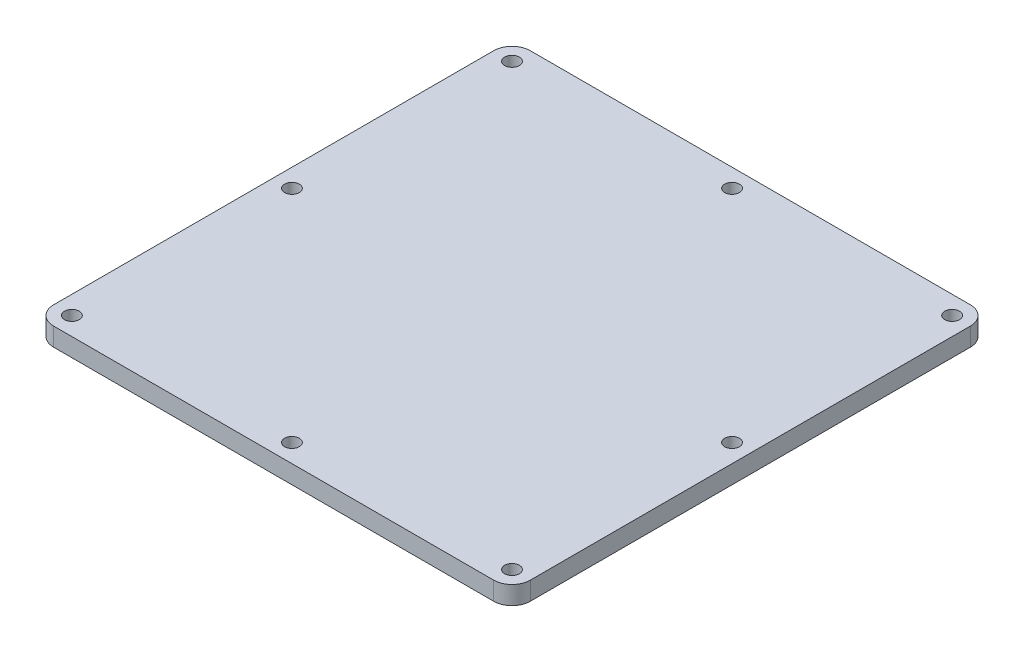
ISO-10303-21;
HEADER;
FILE_DESCRIPTION(('STEP AP214'),'2;1');
FILE_NAME('part.step','',(''),(''),'','','');
FILE_SCHEMA(('AUTOMOTIVE_DESIGN { 1 0 10303 214 1 1 1 1 }'));
ENDSEC;
DATA;
#1=APPLICATION_CONTEXT('core data for automotive mechanical design processes');
#2=APPLICATION_PROTOCOL_DEFINITION('international standard','automotive_design',2000,#1);
#3=PRODUCT_CONTEXT('',#1,'mechanical');
#4=PRODUCT('Part','Part','',(#3));
#5=PRODUCT_RELATED_PRODUCT_CATEGORY('part','',(#4));
#6=PRODUCT_DEFINITION_FORMATION('','',#4);
#7=PRODUCT_DEFINITION_CONTEXT('part definition',#1,'design');
#8=PRODUCT_DEFINITION('design','',#6,#7);
#9=PRODUCT_DEFINITION_SHAPE('','',#8);
#10=(LENGTH_UNIT() NAMED_UNIT(*) SI_UNIT(.MILLI.,.METRE.));
#11=(NAMED_UNIT(*) PLANE_ANGLE_UNIT() SI_UNIT($,.RADIAN.));
#12=(NAMED_UNIT(*) SI_UNIT($,.STERADIAN.) SOLID_ANGLE_UNIT());
#13=UNCERTAINTY_MEASURE_WITH_UNIT(LENGTH_MEASURE(1.E-05),#10,'distance_accuracy_value','');
#14=(GEOMETRIC_REPRESENTATION_CONTEXT(3) GLOBAL_UNCERTAINTY_ASSIGNED_CONTEXT((#13)) GLOBAL_UNIT_ASSIGNED_CONTEXT((#10,
#11,#12)) REPRESENTATION_CONTEXT('',''));
#15=CARTESIAN_POINT('',(0.,0.,0.));
#16=DIRECTION('',(0.,0.,1.));
#17=DIRECTION('',(1.,0.,0.));
#18=AXIS2_PLACEMENT_3D('',#15,#16,#17);
#19=CARTESIAN_POINT('',(-82.55,6.35,82.55));
#20=DIRECTION('',(1.,0.,0.));
#21=DIRECTION('',(0.,0.,-1.));
#22=AXIS2_PLACEMENT_3D('',#19,#20,#21);
#23=PLANE('',#22);
#24=DIRECTION('',(0.,0.,1.));
#25=VECTOR('',#24,1.);
#26=CARTESIAN_POINT('',(-82.55,0.,82.55));
#27=LINE('',#26,#25);
#28=CARTESIAN_POINT('',(-82.55,0.,-76.2));
#29=VERTEX_POINT('',#28);
#30=CARTESIAN_POINT('',(-82.55,0.,76.2));
#31=VERTEX_POINT('',#30);
#32=EDGE_CURVE('E159',#29,#31,#27,.T.);
#33=ORIENTED_EDGE('',*,*,#32,.T.);
#34=DIRECTION('',(0.,-1.,0.));
#35=VECTOR('',#34,1.);
#36=CARTESIAN_POINT('',(-82.55,6.35,76.2));
#37=LINE('',#36,#35);
#38=CARTESIAN_POINT('',(-82.55,6.35,76.2));
#39=VERTEX_POINT('',#38);
#40=EDGE_CURVE('E11',#31,#39,#37,.F.);
#41=ORIENTED_EDGE('',*,*,#40,.T.);
#42=DIRECTION('',(0.,0.,1.));
#43=VECTOR('',#42,1.);
#44=CARTESIAN_POINT('',(-82.55,6.35,82.55));
#45=LINE('',#44,#43);
#46=CARTESIAN_POINT('',(-82.55,6.35,-76.2));
#47=VERTEX_POINT('',#46);
#48=EDGE_CURVE('E127',#47,#39,#45,.T.);
#49=ORIENTED_EDGE('',*,*,#48,.F.);
#50=DIRECTION('',(0.,-1.,0.));
#51=VECTOR('',#50,1.);
#52=CARTESIAN_POINT('',(-82.55,6.35,-76.2));
#53=LINE('',#52,#51);
#54=EDGE_CURVE('E43',#47,#29,#53,.T.);
#55=ORIENTED_EDGE('',*,*,#54,.T.);
#56=EDGE_LOOP('',(#33,#41,#49,#55));
#57=FACE_BOUND('',#56,.T.);
#58=ADVANCED_FACE('F35',(#57),#23,.F.);
#59=CARTESIAN_POINT('',(82.55,6.35,82.55));
#60=DIRECTION('',(0.,0.,-1.));
#61=DIRECTION('',(-1.,0.,0.));
#62=AXIS2_PLACEMENT_3D('',#59,#60,#61);
#63=PLANE('',#62);
#64=DIRECTION('',(1.,0.,0.));
#65=VECTOR('',#64,1.);
#66=CARTESIAN_POINT('',(82.55,0.,82.55));
#67=LINE('',#66,#65);
#68=CARTESIAN_POINT('',(-76.2,0.,82.55));
#69=VERTEX_POINT('',#68);
#70=CARTESIAN_POINT('',(76.2,0.,82.55));
#71=VERTEX_POINT('',#70);
#72=EDGE_CURVE('E132',#69,#71,#67,.T.);
#73=ORIENTED_EDGE('',*,*,#72,.T.);
#74=DIRECTION('',(0.,-1.,0.));
#75=VECTOR('',#74,1.);
#76=CARTESIAN_POINT('',(76.2,6.35,82.55));
#77=LINE('',#76,#75);
#78=CARTESIAN_POINT('',(76.2,6.35,82.55));
#79=VERTEX_POINT('',#78);
#80=EDGE_CURVE('E50',#71,#79,#77,.F.);
#81=ORIENTED_EDGE('',*,*,#80,.T.);
#82=DIRECTION('',(1.,0.,0.));
#83=VECTOR('',#82,1.);
#84=CARTESIAN_POINT('',(82.55,6.35,82.55));
#85=LINE('',#84,#83);
#86=CARTESIAN_POINT('',(-76.2,6.35,82.55));
#87=VERTEX_POINT('',#86);
#88=EDGE_CURVE('E130',#87,#79,#85,.T.);
#89=ORIENTED_EDGE('',*,*,#88,.F.);
#90=DIRECTION('',(0.,-1.,0.));
#91=VECTOR('',#90,1.);
#92=CARTESIAN_POINT('',(-76.2,6.35,82.55));
#93=LINE('',#92,#91);
#94=EDGE_CURVE('E151',#87,#69,#93,.T.);
#95=ORIENTED_EDGE('',*,*,#94,.T.);
#96=EDGE_LOOP('',(#73,#81,#89,#95));
#97=FACE_BOUND('',#96,.T.);
#98=ADVANCED_FACE('F246',(#97),#63,.F.);
#99=CARTESIAN_POINT('',(82.55,6.35,82.55));
#100=DIRECTION('',(-1.,0.,0.));
#101=DIRECTION('',(0.,0.,1.));
#102=AXIS2_PLACEMENT_3D('',#99,#100,#101);
#103=PLANE('',#102);
#104=DIRECTION('',(0.,0.,-1.));
#105=VECTOR('',#104,1.);
#106=CARTESIAN_POINT('',(82.55,0.,82.55));
#107=LINE('',#106,#105);
#108=CARTESIAN_POINT('',(82.55,0.,76.2));
#109=VERTEX_POINT('',#108);
#110=CARTESIAN_POINT('',(82.55,0.,-76.2));
#111=VERTEX_POINT('',#110);
#112=EDGE_CURVE('E128',#109,#111,#107,.T.);
#113=ORIENTED_EDGE('',*,*,#112,.T.);
#114=DIRECTION('',(0.,-1.,0.));
#115=VECTOR('',#114,1.);
#116=CARTESIAN_POINT('',(82.55,6.35,-76.2));
#117=LINE('',#116,#115);
#118=CARTESIAN_POINT('',(82.55,6.35,-76.2));
#119=VERTEX_POINT('',#118);
#120=EDGE_CURVE('E106',#111,#119,#117,.F.);
#121=ORIENTED_EDGE('',*,*,#120,.T.);
#122=DIRECTION('',(0.,0.,-1.));
#123=VECTOR('',#122,1.);
#124=CARTESIAN_POINT('',(82.55,6.35,82.55));
#125=LINE('',#124,#123);
#126=CARTESIAN_POINT('',(82.55,6.35,76.2));
#127=VERTEX_POINT('',#126);
#128=EDGE_CURVE('E171',#127,#119,#125,.T.);
#129=ORIENTED_EDGE('',*,*,#128,.F.);
#130=DIRECTION('',(0.,-1.,0.));
#131=VECTOR('',#130,1.);
#132=CARTESIAN_POINT('',(82.55,6.35,76.2));
#133=LINE('',#132,#131);
#134=EDGE_CURVE('E111',#127,#109,#133,.T.);
#135=ORIENTED_EDGE('',*,*,#134,.T.);
#136=EDGE_LOOP('',(#113,#121,#129,#135));
#137=FACE_BOUND('',#136,.T.);
#138=ADVANCED_FACE('F243',(#137),#103,.F.);
#139=CARTESIAN_POINT('',(82.55,6.35,-82.55));
#140=DIRECTION('',(0.,0.,1.));
#141=DIRECTION('',(1.,0.,0.));
#142=AXIS2_PLACEMENT_3D('',#139,#140,#141);
#143=PLANE('',#142);
#144=DIRECTION('',(-1.,0.,0.));
#145=VECTOR('',#144,1.);
#146=CARTESIAN_POINT('',(82.55,6.35,-82.55));
#147=LINE('',#146,#145);
#148=CARTESIAN_POINT('',(76.2,6.35,-82.55));
#149=VERTEX_POINT('',#148);
#150=CARTESIAN_POINT('',(-76.2,6.35,-82.55));
#151=VERTEX_POINT('',#150);
#152=EDGE_CURVE('E121',#149,#151,#147,.T.);
#153=ORIENTED_EDGE('',*,*,#152,.F.);
#154=DIRECTION('',(0.,-1.,0.));
#155=VECTOR('',#154,1.);
#156=CARTESIAN_POINT('',(76.2,6.35,-82.55));
#157=LINE('',#156,#155);
#158=CARTESIAN_POINT('',(76.2,0.,-82.55));
#159=VERTEX_POINT('',#158);
#160=EDGE_CURVE('E105',#149,#159,#157,.T.);
#161=ORIENTED_EDGE('',*,*,#160,.T.);
#162=DIRECTION('',(-1.,0.,0.));
#163=VECTOR('',#162,1.);
#164=CARTESIAN_POINT('',(82.55,0.,-82.55));
#165=LINE('',#164,#163);
#166=CARTESIAN_POINT('',(-76.2,0.,-82.55));
#167=VERTEX_POINT('',#166);
#168=EDGE_CURVE('E118',#159,#167,#165,.T.);
#169=ORIENTED_EDGE('',*,*,#168,.T.);
#170=DIRECTION('',(0.,-1.,0.));
#171=VECTOR('',#170,1.);
#172=CARTESIAN_POINT('',(-76.2,6.35,-82.55));
#173=LINE('',#172,#171);
#174=EDGE_CURVE('E123',#167,#151,#173,.F.);
#175=ORIENTED_EDGE('',*,*,#174,.T.);
#176=EDGE_LOOP('',(#153,#161,#169,#175));
#177=FACE_BOUND('',#176,.T.);
#178=ADVANCED_FACE('F117',(#177),#143,.F.);
#179=CARTESIAN_POINT('',(0.,6.35,0.));
#180=DIRECTION('',(0.,1.,0.));
#181=DIRECTION('',(0.,0.,1.));
#182=AXIS2_PLACEMENT_3D('',#179,#180,#181);
#183=PLANE('',#182);
#184=CARTESIAN_POINT('',(-76.2,6.35,76.2));
#185=DIRECTION('',(0.,1.,0.));
#186=DIRECTION('',(0.,0.,1.));
#187=AXIS2_PLACEMENT_3D('',#184,#185,#186);
#188=CIRCLE('',#187,2.55269999999999);
#189=CARTESIAN_POINT('',(-76.2,6.35,78.7527));
#190=VERTEX_POINT('',#189);
#191=EDGE_CURVE('E216',#190,#190,#188,.T.);
#192=ORIENTED_EDGE('',*,*,#191,.F.);
#193=EDGE_LOOP('',(#192));
#194=FACE_BOUND('',#193,.T.);
#195=CARTESIAN_POINT('',(-76.2,6.35,-76.2));
#196=DIRECTION('',(0.,1.,0.));
#197=DIRECTION('',(0.,0.,1.));
#198=AXIS2_PLACEMENT_3D('',#195,#196,#197);
#199=CIRCLE('',#198,2.55269999999999);
#200=CARTESIAN_POINT('',(-76.2,6.35,-73.6473));
#201=VERTEX_POINT('',#200);
#202=EDGE_CURVE('E210',#201,#201,#199,.T.);
#203=ORIENTED_EDGE('',*,*,#202,.F.);
#204=EDGE_LOOP('',(#203));
#205=FACE_BOUND('',#204,.T.);
#206=CARTESIAN_POINT('',(76.2,6.35,-76.2));
#207=DIRECTION('',(0.,1.,0.));
#208=DIRECTION('',(0.,0.,1.));
#209=AXIS2_PLACEMENT_3D('',#206,#207,#208);
#210=CIRCLE('',#209,2.55269999999999);
#211=CARTESIAN_POINT('',(76.2,6.35,-73.6473));
#212=VERTEX_POINT('',#211);
#213=EDGE_CURVE('E204',#212,#212,#210,.T.);
#214=ORIENTED_EDGE('',*,*,#213,.F.);
#215=EDGE_LOOP('',(#214));
#216=FACE_BOUND('',#215,.T.);
#217=CARTESIAN_POINT('',(76.2,6.35,76.2));
#218=DIRECTION('',(0.,1.,0.));
#219=DIRECTION('',(0.,0.,1.));
#220=AXIS2_PLACEMENT_3D('',#217,#218,#219);
#221=CIRCLE('',#220,2.55269999999999);
#222=CARTESIAN_POINT('',(76.2,6.35,78.7527));
#223=VERTEX_POINT('',#222);
#224=EDGE_CURVE('E198',#223,#223,#221,.T.);
#225=ORIENTED_EDGE('',*,*,#224,.F.);
#226=EDGE_LOOP('',(#225));
#227=FACE_BOUND('',#226,.T.);
#228=CARTESIAN_POINT('',(0.,6.35,-76.2));
#229=DIRECTION('',(0.,1.,0.));
#230=DIRECTION('',(0.,0.,1.));
#231=AXIS2_PLACEMENT_3D('',#228,#229,#230);
#232=CIRCLE('',#231,2.5527);
#233=CARTESIAN_POINT('',(0.,6.35,-73.6473));
#234=VERTEX_POINT('',#233);
#235=EDGE_CURVE('E192',#234,#234,#232,.T.);
#236=ORIENTED_EDGE('',*,*,#235,.F.);
#237=EDGE_LOOP('',(#236));
#238=FACE_BOUND('',#237,.T.);
#239=CARTESIAN_POINT('',(0.,6.35,76.2));
#240=DIRECTION('',(0.,1.,0.));
#241=DIRECTION('',(0.,0.,1.));
#242=AXIS2_PLACEMENT_3D('',#239,#240,#241);
#243=CIRCLE('',#242,2.5527);
#244=CARTESIAN_POINT('',(0.,6.35,78.7527));
#245=VERTEX_POINT('',#244);
#246=EDGE_CURVE('E186',#245,#245,#243,.T.);
#247=ORIENTED_EDGE('',*,*,#246,.F.);
#248=EDGE_LOOP('',(#247));
#249=FACE_BOUND('',#248,.T.);
#250=CARTESIAN_POINT('',(-76.2,6.35,0.));
#251=DIRECTION('',(0.,1.,0.));
#252=DIRECTION('',(0.,0.,1.));
#253=AXIS2_PLACEMENT_3D('',#250,#251,#252);
#254=CIRCLE('',#253,2.55269999999999);
#255=CARTESIAN_POINT('',(-76.2,6.35,2.55270000000002));
#256=VERTEX_POINT('',#255);
#257=EDGE_CURVE('E180',#256,#256,#254,.T.);
#258=ORIENTED_EDGE('',*,*,#257,.F.);
#259=EDGE_LOOP('',(#258));
#260=FACE_BOUND('',#259,.T.);
#261=CARTESIAN_POINT('',(76.2,6.35,0.));
#262=DIRECTION('',(0.,1.,0.));
#263=DIRECTION('',(0.,0.,1.));
#264=AXIS2_PLACEMENT_3D('',#261,#262,#263);
#265=CIRCLE('',#264,2.55269999999999);
#266=CARTESIAN_POINT('',(76.2,6.35,2.5527));
#267=VERTEX_POINT('',#266);
#268=EDGE_CURVE('E167',#267,#267,#265,.T.);
#269=ORIENTED_EDGE('',*,*,#268,.F.);
#270=EDGE_LOOP('',(#269));
#271=FACE_BOUND('',#270,.T.);
#272=ORIENTED_EDGE('',*,*,#128,.T.);
#273=CARTESIAN_POINT('',(76.2,6.35,-76.2));
#274=DIRECTION('',(0.,1.,0.));
#275=DIRECTION('',(0.,0.,1.));
#276=AXIS2_PLACEMENT_3D('',#273,#274,#275);
#277=CIRCLE('',#276,6.35);
#278=EDGE_CURVE('E149',#119,#149,#277,.T.);
#279=ORIENTED_EDGE('',*,*,#278,.T.);
#280=ORIENTED_EDGE('',*,*,#152,.T.);
#281=CARTESIAN_POINT('',(-76.2,6.35,-76.2));
#282=DIRECTION('',(0.,1.,0.));
#283=DIRECTION('',(0.,0.,1.));
#284=AXIS2_PLACEMENT_3D('',#281,#282,#283);
#285=CIRCLE('',#284,6.35);
#286=EDGE_CURVE('E144',#151,#47,#285,.T.);
#287=ORIENTED_EDGE('',*,*,#286,.T.);
#288=ORIENTED_EDGE('',*,*,#48,.T.);
#289=CARTESIAN_POINT('',(-76.2,6.35,76.2));
#290=DIRECTION('',(0.,1.,0.));
#291=DIRECTION('',(0.,0.,1.));
#292=AXIS2_PLACEMENT_3D('',#289,#290,#291);
#293=CIRCLE('',#292,6.35);
#294=EDGE_CURVE('E57',#39,#87,#293,.T.);
#295=ORIENTED_EDGE('',*,*,#294,.T.);
#296=ORIENTED_EDGE('',*,*,#88,.T.);
#297=CARTESIAN_POINT('',(76.2,6.35,76.2));
#298=DIRECTION('',(0.,1.,0.));
#299=DIRECTION('',(0.,0.,1.));
#300=AXIS2_PLACEMENT_3D('',#297,#298,#299);
#301=CIRCLE('',#300,6.35);
#302=EDGE_CURVE('E147',#79,#127,#301,.T.);
#303=ORIENTED_EDGE('',*,*,#302,.T.);
#304=EDGE_LOOP('',(#272,#279,#280,#287,#288,#295,#296,#303));
#305=FACE_BOUND('',#304,.T.);
#306=ADVANCED_FACE('F222',(#194,#205,#216,#227,#238,#249,#260,#271,#305),#183,.T.);
#307=CARTESIAN_POINT('',(0.,0.,0.));
#308=DIRECTION('',(0.,1.,0.));
#309=DIRECTION('',(0.,0.,1.));
#310=AXIS2_PLACEMENT_3D('',#307,#308,#309);
#311=PLANE('',#310);
#312=CARTESIAN_POINT('',(-76.2,0.,76.2));
#313=DIRECTION('',(0.,1.,0.));
#314=DIRECTION('',(0.,0.,1.));
#315=AXIS2_PLACEMENT_3D('',#312,#313,#314);
#316=CIRCLE('',#315,2.55269999999999);
#317=CARTESIAN_POINT('',(-76.2,0.,78.7527));
#318=VERTEX_POINT('',#317);
#319=EDGE_CURVE('E213',#318,#318,#316,.T.);
#320=ORIENTED_EDGE('',*,*,#319,.T.);
#321=EDGE_LOOP('',(#320));
#322=FACE_BOUND('',#321,.T.);
#323=CARTESIAN_POINT('',(-76.2,0.,-76.2));
#324=DIRECTION('',(0.,1.,0.));
#325=DIRECTION('',(0.,0.,1.));
#326=AXIS2_PLACEMENT_3D('',#323,#324,#325);
#327=CIRCLE('',#326,2.55269999999999);
#328=CARTESIAN_POINT('',(-76.2,0.,-73.6473));
#329=VERTEX_POINT('',#328);
#330=EDGE_CURVE('E207',#329,#329,#327,.T.);
#331=ORIENTED_EDGE('',*,*,#330,.T.);
#332=EDGE_LOOP('',(#331));
#333=FACE_BOUND('',#332,.T.);
#334=CARTESIAN_POINT('',(76.2,0.,-76.2));
#335=DIRECTION('',(0.,1.,0.));
#336=DIRECTION('',(0.,0.,1.));
#337=AXIS2_PLACEMENT_3D('',#334,#335,#336);
#338=CIRCLE('',#337,2.55269999999999);
#339=CARTESIAN_POINT('',(76.2,0.,-73.6473));
#340=VERTEX_POINT('',#339);
#341=EDGE_CURVE('E201',#340,#340,#338,.T.);
#342=ORIENTED_EDGE('',*,*,#341,.T.);
#343=EDGE_LOOP('',(#342));
#344=FACE_BOUND('',#343,.T.);
#345=CARTESIAN_POINT('',(76.2,0.,76.2));
#346=DIRECTION('',(0.,1.,0.));
#347=DIRECTION('',(0.,0.,1.));
#348=AXIS2_PLACEMENT_3D('',#345,#346,#347);
#349=CIRCLE('',#348,2.55269999999999);
#350=CARTESIAN_POINT('',(76.2,0.,78.7527));
#351=VERTEX_POINT('',#350);
#352=EDGE_CURVE('E195',#351,#351,#349,.T.);
#353=ORIENTED_EDGE('',*,*,#352,.T.);
#354=EDGE_LOOP('',(#353));
#355=FACE_BOUND('',#354,.T.);
#356=CARTESIAN_POINT('',(0.,0.,-76.2));
#357=DIRECTION('',(0.,1.,0.));
#358=DIRECTION('',(0.,0.,1.));
#359=AXIS2_PLACEMENT_3D('',#356,#357,#358);
#360=CIRCLE('',#359,2.5527);
#361=CARTESIAN_POINT('',(0.,0.,-73.6473));
#362=VERTEX_POINT('',#361);
#363=EDGE_CURVE('E189',#362,#362,#360,.T.);
#364=ORIENTED_EDGE('',*,*,#363,.T.);
#365=EDGE_LOOP('',(#364));
#366=FACE_BOUND('',#365,.T.);
#367=CARTESIAN_POINT('',(0.,0.,76.2));
#368=DIRECTION('',(0.,1.,0.));
#369=DIRECTION('',(0.,0.,1.));
#370=AXIS2_PLACEMENT_3D('',#367,#368,#369);
#371=CIRCLE('',#370,2.5527);
#372=CARTESIAN_POINT('',(0.,0.,78.7527));
#373=VERTEX_POINT('',#372);
#374=EDGE_CURVE('E183',#373,#373,#371,.T.);
#375=ORIENTED_EDGE('',*,*,#374,.T.);
#376=EDGE_LOOP('',(#375));
#377=FACE_BOUND('',#376,.T.);
#378=CARTESIAN_POINT('',(-76.2,0.,0.));
#379=DIRECTION('',(0.,1.,0.));
#380=DIRECTION('',(0.,0.,1.));
#381=AXIS2_PLACEMENT_3D('',#378,#379,#380);
#382=CIRCLE('',#381,2.55269999999999);
#383=CARTESIAN_POINT('',(-76.2,0.,2.55270000000002));
#384=VERTEX_POINT('',#383);
#385=EDGE_CURVE('E177',#384,#384,#382,.T.);
#386=ORIENTED_EDGE('',*,*,#385,.T.);
#387=EDGE_LOOP('',(#386));
#388=FACE_BOUND('',#387,.T.);
#389=CARTESIAN_POINT('',(76.2,0.,0.));
#390=DIRECTION('',(0.,1.,0.));
#391=DIRECTION('',(0.,0.,1.));
#392=AXIS2_PLACEMENT_3D('',#389,#390,#391);
#393=CIRCLE('',#392,2.55269999999999);
#394=CARTESIAN_POINT('',(76.2,0.,2.5527));
#395=VERTEX_POINT('',#394);
#396=EDGE_CURVE('E164',#395,#395,#393,.T.);
#397=ORIENTED_EDGE('',*,*,#396,.T.);
#398=EDGE_LOOP('',(#397));
#399=FACE_BOUND('',#398,.T.);
#400=ORIENTED_EDGE('',*,*,#168,.F.);
#401=CARTESIAN_POINT('',(76.2,0.,-76.2));
#402=DIRECTION('',(0.,1.,0.));
#403=DIRECTION('',(0.,0.,1.));
#404=AXIS2_PLACEMENT_3D('',#401,#402,#403);
#405=CIRCLE('',#404,6.35);
#406=EDGE_CURVE('E101',#159,#111,#405,.F.);
#407=ORIENTED_EDGE('',*,*,#406,.T.);
#408=ORIENTED_EDGE('',*,*,#112,.F.);
#409=CARTESIAN_POINT('',(76.2,0.,76.2));
#410=DIRECTION('',(0.,1.,0.));
#411=DIRECTION('',(0.,0.,1.));
#412=AXIS2_PLACEMENT_3D('',#409,#410,#411);
#413=CIRCLE('',#412,6.35);
#414=EDGE_CURVE('E112',#109,#71,#413,.F.);
#415=ORIENTED_EDGE('',*,*,#414,.T.);
#416=ORIENTED_EDGE('',*,*,#72,.F.);
#417=CARTESIAN_POINT('',(-76.2,0.,76.2));
#418=DIRECTION('',(0.,1.,0.));
#419=DIRECTION('',(0.,0.,1.));
#420=AXIS2_PLACEMENT_3D('',#417,#418,#419);
#421=CIRCLE('',#420,6.35);
#422=EDGE_CURVE('E138',#69,#31,#421,.F.);
#423=ORIENTED_EDGE('',*,*,#422,.T.);
#424=ORIENTED_EDGE('',*,*,#32,.F.);
#425=CARTESIAN_POINT('',(-76.2,0.,-76.2));
#426=DIRECTION('',(0.,1.,0.));
#427=DIRECTION('',(0.,0.,1.));
#428=AXIS2_PLACEMENT_3D('',#425,#426,#427);
#429=CIRCLE('',#428,6.35);
#430=EDGE_CURVE('E122',#29,#167,#429,.F.);
#431=ORIENTED_EDGE('',*,*,#430,.T.);
#432=EDGE_LOOP('',(#400,#407,#408,#415,#416,#423,#424,#431));
#433=FACE_BOUND('',#432,.T.);
#434=ADVANCED_FACE('F125',(#322,#333,#344,#355,#366,#377,#388,#399,#433),#311,.F.);
#435=CARTESIAN_POINT('',(76.2,6.35,-76.2));
#436=DIRECTION('',(0.,-1.,0.));
#437=DIRECTION('',(0.,0.,-1.));
#438=AXIS2_PLACEMENT_3D('',#435,#436,#437);
#439=CYLINDRICAL_SURFACE('',#438,6.35);
#440=ORIENTED_EDGE('',*,*,#278,.F.);
#441=ORIENTED_EDGE('',*,*,#120,.F.);
#442=ORIENTED_EDGE('',*,*,#406,.F.);
#443=ORIENTED_EDGE('',*,*,#160,.F.);
#444=EDGE_LOOP('',(#440,#441,#442,#443));
#445=FACE_BOUND('',#444,.T.);
#446=ADVANCED_FACE('F104',(#445),#439,.T.);
#447=CARTESIAN_POINT('',(76.2,6.35,76.2));
#448=DIRECTION('',(0.,-1.,0.));
#449=DIRECTION('',(0.,0.,-1.));
#450=AXIS2_PLACEMENT_3D('',#447,#448,#449);
#451=CYLINDRICAL_SURFACE('',#450,6.35);
#452=ORIENTED_EDGE('',*,*,#302,.F.);
#453=ORIENTED_EDGE('',*,*,#80,.F.);
#454=ORIENTED_EDGE('',*,*,#414,.F.);
#455=ORIENTED_EDGE('',*,*,#134,.F.);
#456=EDGE_LOOP('',(#452,#453,#454,#455));
#457=FACE_BOUND('',#456,.T.);
#458=ADVANCED_FACE('F245',(#457),#451,.T.);
#459=CARTESIAN_POINT('',(-76.2,6.35,76.2));
#460=DIRECTION('',(0.,-1.,0.));
#461=DIRECTION('',(0.,0.,-1.));
#462=AXIS2_PLACEMENT_3D('',#459,#460,#461);
#463=CYLINDRICAL_SURFACE('',#462,6.35);
#464=ORIENTED_EDGE('',*,*,#294,.F.);
#465=ORIENTED_EDGE('',*,*,#40,.F.);
#466=ORIENTED_EDGE('',*,*,#422,.F.);
#467=ORIENTED_EDGE('',*,*,#94,.F.);
#468=EDGE_LOOP('',(#464,#465,#466,#467));
#469=FACE_BOUND('',#468,.T.);
#470=ADVANCED_FACE('F249',(#469),#463,.T.);
#471=CARTESIAN_POINT('',(-76.2,6.35,-76.2));
#472=DIRECTION('',(0.,-1.,0.));
#473=DIRECTION('',(0.,0.,-1.));
#474=AXIS2_PLACEMENT_3D('',#471,#472,#473);
#475=CYLINDRICAL_SURFACE('',#474,6.35);
#476=ORIENTED_EDGE('',*,*,#286,.F.);
#477=ORIENTED_EDGE('',*,*,#174,.F.);
#478=ORIENTED_EDGE('',*,*,#430,.F.);
#479=ORIENTED_EDGE('',*,*,#54,.F.);
#480=EDGE_LOOP('',(#476,#477,#478,#479));
#481=FACE_BOUND('',#480,.T.);
#482=ADVANCED_FACE('F37',(#481),#475,.T.);
#483=CARTESIAN_POINT('',(76.2,6.35,0.));
#484=DIRECTION('',(0.,1.,0.));
#485=DIRECTION('',(0.,0.,1.));
#486=AXIS2_PLACEMENT_3D('',#483,#484,#485);
#487=CYLINDRICAL_SURFACE('',#486,2.55269999999999);
#488=ORIENTED_EDGE('',*,*,#396,.F.);
#489=EDGE_LOOP('',(#488));
#490=FACE_BOUND('',#489,.T.);
#491=ORIENTED_EDGE('',*,*,#268,.T.);
#492=EDGE_LOOP('',(#491));
#493=FACE_BOUND('',#492,.T.);
#494=ADVANCED_FACE('F251',(#490,#493),#487,.F.);
#495=CARTESIAN_POINT('',(-76.2,6.35,0.));
#496=DIRECTION('',(0.,1.,0.));
#497=DIRECTION('',(0.,0.,1.));
#498=AXIS2_PLACEMENT_3D('',#495,#496,#497);
#499=CYLINDRICAL_SURFACE('',#498,2.55269999999999);
#500=ORIENTED_EDGE('',*,*,#385,.F.);
#501=EDGE_LOOP('',(#500));
#502=FACE_BOUND('',#501,.T.);
#503=ORIENTED_EDGE('',*,*,#257,.T.);
#504=EDGE_LOOP('',(#503));
#505=FACE_BOUND('',#504,.T.);
#506=ADVANCED_FACE('F256',(#502,#505),#499,.F.);
#507=CARTESIAN_POINT('',(0.,6.35,76.2));
#508=DIRECTION('',(0.,1.,0.));
#509=DIRECTION('',(0.,0.,1.));
#510=AXIS2_PLACEMENT_3D('',#507,#508,#509);
#511=CYLINDRICAL_SURFACE('',#510,2.5527);
#512=ORIENTED_EDGE('',*,*,#374,.F.);
#513=EDGE_LOOP('',(#512));
#514=FACE_BOUND('',#513,.T.);
#515=ORIENTED_EDGE('',*,*,#246,.T.);
#516=EDGE_LOOP('',(#515));
#517=FACE_BOUND('',#516,.T.);
#518=ADVANCED_FACE('F315',(#514,#517),#511,.F.);
#519=CARTESIAN_POINT('',(0.,6.35,-76.2));
#520=DIRECTION('',(0.,1.,0.));
#521=DIRECTION('',(0.,0.,1.));
#522=AXIS2_PLACEMENT_3D('',#519,#520,#521);
#523=CYLINDRICAL_SURFACE('',#522,2.5527);
#524=ORIENTED_EDGE('',*,*,#363,.F.);
#525=EDGE_LOOP('',(#524));
#526=FACE_BOUND('',#525,.T.);
#527=ORIENTED_EDGE('',*,*,#235,.T.);
#528=EDGE_LOOP('',(#527));
#529=FACE_BOUND('',#528,.T.);
#530=ADVANCED_FACE('F325',(#526,#529),#523,.F.);
#531=CARTESIAN_POINT('',(76.2,6.35,76.2));
#532=DIRECTION('',(0.,1.,0.));
#533=DIRECTION('',(0.,0.,1.));
#534=AXIS2_PLACEMENT_3D('',#531,#532,#533);
#535=CYLINDRICAL_SURFACE('',#534,2.55269999999999);
#536=ORIENTED_EDGE('',*,*,#352,.F.);
#537=EDGE_LOOP('',(#536));
#538=FACE_BOUND('',#537,.T.);
#539=ORIENTED_EDGE('',*,*,#224,.T.);
#540=EDGE_LOOP('',(#539));
#541=FACE_BOUND('',#540,.T.);
#542=ADVANCED_FACE('F335',(#538,#541),#535,.F.);
#543=CARTESIAN_POINT('',(76.2,6.35,-76.2));
#544=DIRECTION('',(0.,1.,0.));
#545=DIRECTION('',(0.,0.,1.));
#546=AXIS2_PLACEMENT_3D('',#543,#544,#545);
#547=CYLINDRICAL_SURFACE('',#546,2.55269999999999);
#548=ORIENTED_EDGE('',*,*,#341,.F.);
#549=EDGE_LOOP('',(#548));
#550=FACE_BOUND('',#549,.T.);
#551=ORIENTED_EDGE('',*,*,#213,.T.);
#552=EDGE_LOOP('',(#551));
#553=FACE_BOUND('',#552,.T.);
#554=ADVANCED_FACE('F346',(#550,#553),#547,.F.);
#555=CARTESIAN_POINT('',(-76.2,6.35,-76.2));
#556=DIRECTION('',(0.,1.,0.));
#557=DIRECTION('',(0.,0.,1.));
#558=AXIS2_PLACEMENT_3D('',#555,#556,#557);
#559=CYLINDRICAL_SURFACE('',#558,2.55269999999999);
#560=ORIENTED_EDGE('',*,*,#330,.F.);
#561=EDGE_LOOP('',(#560));
#562=FACE_BOUND('',#561,.T.);
#563=ORIENTED_EDGE('',*,*,#202,.T.);
#564=EDGE_LOOP('',(#563));
#565=FACE_BOUND('',#564,.T.);
#566=ADVANCED_FACE('F357',(#562,#565),#559,.F.);
#567=CARTESIAN_POINT('',(-76.2,6.35,76.2));
#568=DIRECTION('',(0.,1.,0.));
#569=DIRECTION('',(0.,0.,1.));
#570=AXIS2_PLACEMENT_3D('',#567,#568,#569);
#571=CYLINDRICAL_SURFACE('',#570,2.55269999999999);
#572=ORIENTED_EDGE('',*,*,#319,.F.);
#573=EDGE_LOOP('',(#572));
#574=FACE_BOUND('',#573,.T.);
#575=ORIENTED_EDGE('',*,*,#191,.T.);
#576=EDGE_LOOP('',(#575));
#577=FACE_BOUND('',#576,.T.);
#578=ADVANCED_FACE('F220',(#574,#577),#571,.F.);
#579=CLOSED_SHELL('',(#58,#98,#138,#178,#306,#434,#446,#458,#470,#482,#494,#506,#518,#530,#542,
#554,#566,#578));
#580=MANIFOLD_SOLID_BREP('B2',#579);
#581=ADVANCED_BREP_SHAPE_REPRESENTATION('',(#18,#580),#14);
#582=SHAPE_DEFINITION_REPRESENTATION(#9,#581);
ENDSEC;
END-ISO-10303-21;
